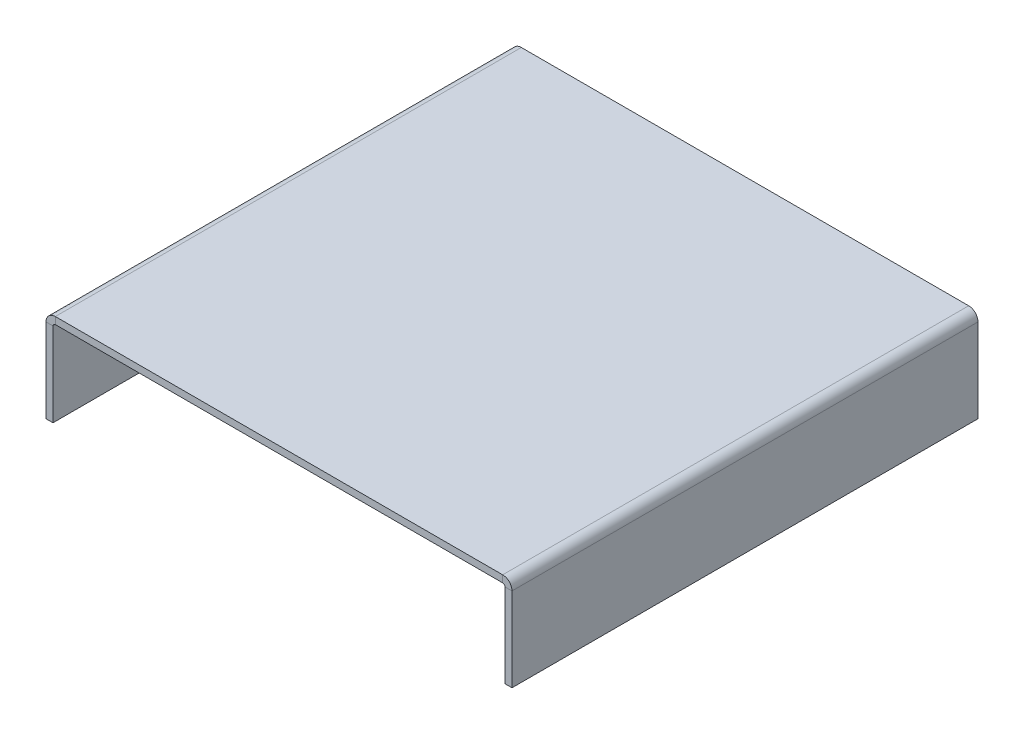
ISO-10303-21;
HEADER;
FILE_DESCRIPTION(('STEP AP214'),'2;1');
FILE_NAME('part.step','',(''),(''),'','','');
FILE_SCHEMA(('AUTOMOTIVE_DESIGN { 1 0 10303 214 1 1 1 1 }'));
ENDSEC;
DATA;
#1=APPLICATION_CONTEXT('core data for automotive mechanical design processes');
#2=APPLICATION_PROTOCOL_DEFINITION('international standard','automotive_design',2000,#1);
#3=PRODUCT_CONTEXT('',#1,'mechanical');
#4=PRODUCT('Part','Part','',(#3));
#5=PRODUCT_RELATED_PRODUCT_CATEGORY('part','',(#4));
#6=PRODUCT_DEFINITION_FORMATION('','',#4);
#7=PRODUCT_DEFINITION_CONTEXT('part definition',#1,'design');
#8=PRODUCT_DEFINITION('design','',#6,#7);
#9=PRODUCT_DEFINITION_SHAPE('','',#8);
#10=(LENGTH_UNIT() NAMED_UNIT(*) SI_UNIT(.MILLI.,.METRE.));
#11=(NAMED_UNIT(*) PLANE_ANGLE_UNIT() SI_UNIT($,.RADIAN.));
#12=(NAMED_UNIT(*) SI_UNIT($,.STERADIAN.) SOLID_ANGLE_UNIT());
#13=UNCERTAINTY_MEASURE_WITH_UNIT(LENGTH_MEASURE(1.E-05),#10,'distance_accuracy_value','');
#14=(GEOMETRIC_REPRESENTATION_CONTEXT(3) GLOBAL_UNCERTAINTY_ASSIGNED_CONTEXT((#13)) GLOBAL_UNIT_ASSIGNED_CONTEXT((#10,
#11,#12)) REPRESENTATION_CONTEXT('',''));
#15=CARTESIAN_POINT('',(0.,0.,0.));
#16=DIRECTION('',(0.,0.,1.));
#17=DIRECTION('',(1.,0.,0.));
#18=AXIS2_PLACEMENT_3D('',#15,#16,#17);
#19=CARTESIAN_POINT('',(0.,-1.5,0.));
#20=DIRECTION('',(0.,-1.,0.));
#21=DIRECTION('',(0.,0.,-1.));
#22=AXIS2_PLACEMENT_3D('',#19,#20,#21);
#23=PLANE('',#22);
#24=DIRECTION('',(1.,0.,0.));
#25=VECTOR('',#24,1.);
#26=CARTESIAN_POINT('',(50.,-1.5,50.));
#27=LINE('',#26,#25);
#28=CARTESIAN_POINT('',(-48.,-1.50000000000001,50.));
#29=VERTEX_POINT('',#28);
#30=CARTESIAN_POINT('',(48.,-1.5,50.));
#31=VERTEX_POINT('',#30);
#32=EDGE_CURVE('E84',#29,#31,#27,.T.);
#33=ORIENTED_EDGE('',*,*,#32,.F.);
#34=DIRECTION('',(0.,0.,-1.));
#35=VECTOR('',#34,1.);
#36=CARTESIAN_POINT('',(-48.,-1.50000000000001,-50.));
#37=LINE('',#36,#35);
#38=CARTESIAN_POINT('',(-48.,-1.50000000000001,-50.));
#39=VERTEX_POINT('',#38);
#40=EDGE_CURVE('E220',#39,#29,#37,.F.);
#41=ORIENTED_EDGE('',*,*,#40,.F.);
#42=DIRECTION('',(-1.,0.,0.));
#43=VECTOR('',#42,1.);
#44=CARTESIAN_POINT('',(50.,-1.5,-50.));
#45=LINE('',#44,#43);
#46=CARTESIAN_POINT('',(48.,-1.5,-50.));
#47=VERTEX_POINT('',#46);
#48=EDGE_CURVE('E13',#47,#39,#45,.T.);
#49=ORIENTED_EDGE('',*,*,#48,.F.);
#50=DIRECTION('',(0.,0.,1.));
#51=VECTOR('',#50,1.);
#52=CARTESIAN_POINT('',(48.,-1.5,50.));
#53=LINE('',#52,#51);
#54=EDGE_CURVE('E274',#31,#47,#53,.F.);
#55=ORIENTED_EDGE('',*,*,#54,.F.);
#56=EDGE_LOOP('',(#33,#41,#49,#55));
#57=FACE_BOUND('',#56,.T.);
#58=ADVANCED_FACE('F75',(#57),#23,.T.);
#59=CARTESIAN_POINT('',(0.,0.,0.));
#60=DIRECTION('',(0.,-1.,0.));
#61=DIRECTION('',(0.,0.,-1.));
#62=AXIS2_PLACEMENT_3D('',#59,#60,#61);
#63=PLANE('',#62);
#64=DIRECTION('',(0.,0.,-1.));
#65=VECTOR('',#64,1.);
#66=CARTESIAN_POINT('',(-48.,0.,-50.));
#67=LINE('',#66,#65);
#68=CARTESIAN_POINT('',(-48.,0.,-50.));
#69=VERTEX_POINT('',#68);
#70=CARTESIAN_POINT('',(-48.,0.,50.));
#71=VERTEX_POINT('',#70);
#72=EDGE_CURVE('E208',#69,#71,#67,.F.);
#73=ORIENTED_EDGE('',*,*,#72,.T.);
#74=DIRECTION('',(1.,0.,0.));
#75=VECTOR('',#74,1.);
#76=CARTESIAN_POINT('',(50.,0.,50.));
#77=LINE('',#76,#75);
#78=CARTESIAN_POINT('',(48.,0.,50.));
#79=VERTEX_POINT('',#78);
#80=EDGE_CURVE('E280',#71,#79,#77,.T.);
#81=ORIENTED_EDGE('',*,*,#80,.T.);
#82=DIRECTION('',(0.,0.,1.));
#83=VECTOR('',#82,1.);
#84=CARTESIAN_POINT('',(48.,0.,50.));
#85=LINE('',#84,#83);
#86=CARTESIAN_POINT('',(48.,0.,-50.));
#87=VERTEX_POINT('',#86);
#88=EDGE_CURVE('E262',#79,#87,#85,.F.);
#89=ORIENTED_EDGE('',*,*,#88,.T.);
#90=DIRECTION('',(-1.,0.,0.));
#91=VECTOR('',#90,1.);
#92=CARTESIAN_POINT('',(50.,0.,-50.));
#93=LINE('',#92,#91);
#94=EDGE_CURVE('E79',#87,#69,#93,.T.);
#95=ORIENTED_EDGE('',*,*,#94,.T.);
#96=EDGE_LOOP('',(#73,#81,#89,#95));
#97=FACE_BOUND('',#96,.T.);
#98=ADVANCED_FACE('F286',(#97),#63,.F.);
#99=CARTESIAN_POINT('',(50.,-1.5,-50.));
#100=DIRECTION('',(0.,0.,-1.));
#101=DIRECTION('',(-1.,0.,0.));
#102=AXIS2_PLACEMENT_3D('',#99,#100,#101);
#103=PLANE('',#102);
#104=ORIENTED_EDGE('',*,*,#48,.T.);
#105=DIRECTION('',(0.,1.,0.));
#106=VECTOR('',#105,1.);
#107=CARTESIAN_POINT('',(-48.,-1.50000000000001,-50.));
#108=LINE('',#107,#106);
#109=EDGE_CURVE('E214',#39,#69,#108,.T.);
#110=ORIENTED_EDGE('',*,*,#109,.T.);
#111=ORIENTED_EDGE('',*,*,#94,.F.);
#112=DIRECTION('',(0.,1.,0.));
#113=VECTOR('',#112,1.);
#114=CARTESIAN_POINT('',(48.,-1.5,-50.));
#115=LINE('',#114,#113);
#116=EDGE_CURVE('E98',#47,#87,#115,.T.);
#117=ORIENTED_EDGE('',*,*,#116,.F.);
#118=EDGE_LOOP('',(#104,#110,#111,#117));
#119=FACE_BOUND('',#118,.T.);
#120=ADVANCED_FACE('F289',(#119),#103,.T.);
#121=CARTESIAN_POINT('',(50.,-1.5,50.));
#122=DIRECTION('',(0.,0.,1.));
#123=DIRECTION('',(1.,0.,0.));
#124=AXIS2_PLACEMENT_3D('',#121,#122,#123);
#125=PLANE('',#124);
#126=DIRECTION('',(0.,1.,0.));
#127=VECTOR('',#126,1.);
#128=CARTESIAN_POINT('',(-48.,-1.50000000000001,50.));
#129=LINE('',#128,#127);
#130=EDGE_CURVE('E226',#29,#71,#129,.T.);
#131=ORIENTED_EDGE('',*,*,#130,.F.);
#132=ORIENTED_EDGE('',*,*,#32,.T.);
#133=DIRECTION('',(0.,1.,0.));
#134=VECTOR('',#133,1.);
#135=CARTESIAN_POINT('',(48.,-1.5,50.));
#136=LINE('',#135,#134);
#137=EDGE_CURVE('E268',#31,#79,#136,.T.);
#138=ORIENTED_EDGE('',*,*,#137,.T.);
#139=ORIENTED_EDGE('',*,*,#80,.F.);
#140=EDGE_LOOP('',(#131,#132,#138,#139));
#141=FACE_BOUND('',#140,.T.);
#142=ADVANCED_FACE('F77',(#141),#125,.T.);
#143=CARTESIAN_POINT('',(48.,-2.,-50.));
#144=DIRECTION('',(0.,0.,-1.));
#145=DIRECTION('',(-1.,0.,0.));
#146=AXIS2_PLACEMENT_3D('',#143,#144,#145);
#147=PLANE('',#146);
#148=DIRECTION('',(-1.,0.,0.));
#149=VECTOR('',#148,1.);
#150=CARTESIAN_POINT('',(50.,-2.,-50.));
#151=LINE('',#150,#149);
#152=CARTESIAN_POINT('',(48.5,-2.,-50.));
#153=VERTEX_POINT('',#152);
#154=CARTESIAN_POINT('',(50.,-2.,-50.));
#155=VERTEX_POINT('',#154);
#156=EDGE_CURVE('E229',#153,#155,#151,.F.);
#157=ORIENTED_EDGE('',*,*,#156,.F.);
#158=CARTESIAN_POINT('',(48.,-2.,-50.));
#159=DIRECTION('',(0.,0.,1.));
#160=DIRECTION('',(1.,0.,0.));
#161=AXIS2_PLACEMENT_3D('',#158,#159,#160);
#162=CIRCLE('',#161,0.5);
#163=EDGE_CURVE('E271',#47,#153,#162,.F.);
#164=ORIENTED_EDGE('',*,*,#163,.F.);
#165=ORIENTED_EDGE('',*,*,#116,.T.);
#166=CARTESIAN_POINT('',(48.,-2.,-50.));
#167=DIRECTION('',(0.,0.,1.));
#168=DIRECTION('',(1.,0.,0.));
#169=AXIS2_PLACEMENT_3D('',#166,#167,#168);
#170=CIRCLE('',#169,2.);
#171=EDGE_CURVE('E264',#87,#155,#170,.F.);
#172=ORIENTED_EDGE('',*,*,#171,.T.);
#173=EDGE_LOOP('',(#157,#164,#165,#172));
#174=FACE_BOUND('',#173,.T.);
#175=ADVANCED_FACE('F341',(#174),#147,.T.);
#176=CARTESIAN_POINT('',(48.,-2.,50.));
#177=DIRECTION('',(0.,0.,-1.));
#178=DIRECTION('',(-1.,0.,0.));
#179=AXIS2_PLACEMENT_3D('',#176,#177,#178);
#180=PLANE('',#179);
#181=CARTESIAN_POINT('',(48.,-2.,50.));
#182=DIRECTION('',(0.,0.,1.));
#183=DIRECTION('',(1.,0.,0.));
#184=AXIS2_PLACEMENT_3D('',#181,#182,#183);
#185=CIRCLE('',#184,0.5);
#186=CARTESIAN_POINT('',(48.5,-2.,50.));
#187=VERTEX_POINT('',#186);
#188=EDGE_CURVE('E235',#187,#31,#185,.T.);
#189=ORIENTED_EDGE('',*,*,#188,.F.);
#190=DIRECTION('',(-1.,0.,0.));
#191=VECTOR('',#190,1.);
#192=CARTESIAN_POINT('',(48.5,-2.,50.));
#193=LINE('',#192,#191);
#194=CARTESIAN_POINT('',(50.,-2.,50.));
#195=VERTEX_POINT('',#194);
#196=EDGE_CURVE('E255',#187,#195,#193,.F.);
#197=ORIENTED_EDGE('',*,*,#196,.T.);
#198=CARTESIAN_POINT('',(48.,-2.,50.));
#199=DIRECTION('',(0.,0.,1.));
#200=DIRECTION('',(1.,0.,0.));
#201=AXIS2_PLACEMENT_3D('',#198,#199,#200);
#202=CIRCLE('',#201,2.);
#203=EDGE_CURVE('E265',#195,#79,#202,.T.);
#204=ORIENTED_EDGE('',*,*,#203,.T.);
#205=ORIENTED_EDGE('',*,*,#137,.F.);
#206=EDGE_LOOP('',(#189,#197,#204,#205));
#207=FACE_BOUND('',#206,.T.);
#208=ADVANCED_FACE('F314',(#207),#180,.F.);
#209=CARTESIAN_POINT('',(48.,-2.,50.));
#210=DIRECTION('',(0.,0.,1.));
#211=DIRECTION('',(1.,0.,0.));
#212=AXIS2_PLACEMENT_3D('',#209,#210,#211);
#213=CYLINDRICAL_SURFACE('',#212,2.);
#214=ORIENTED_EDGE('',*,*,#88,.F.);
#215=ORIENTED_EDGE('',*,*,#203,.F.);
#216=DIRECTION('',(0.,0.,1.));
#217=VECTOR('',#216,1.);
#218=CARTESIAN_POINT('',(50.,-2.,-50.));
#219=LINE('',#218,#217);
#220=EDGE_CURVE('E253',#195,#155,#219,.F.);
#221=ORIENTED_EDGE('',*,*,#220,.T.);
#222=ORIENTED_EDGE('',*,*,#171,.F.);
#223=EDGE_LOOP('',(#214,#215,#221,#222));
#224=FACE_BOUND('',#223,.T.);
#225=ADVANCED_FACE('F339',(#224),#213,.T.);
#226=CARTESIAN_POINT('',(48.,-2.,50.));
#227=DIRECTION('',(0.,0.,1.));
#228=DIRECTION('',(1.,0.,0.));
#229=AXIS2_PLACEMENT_3D('',#226,#227,#228);
#230=CYLINDRICAL_SURFACE('',#229,0.5);
#231=ORIENTED_EDGE('',*,*,#54,.T.);
#232=ORIENTED_EDGE('',*,*,#163,.T.);
#233=DIRECTION('',(0.,0.,1.));
#234=VECTOR('',#233,1.);
#235=CARTESIAN_POINT('',(48.5,-2.,-50.));
#236=LINE('',#235,#234);
#237=EDGE_CURVE('E258',#153,#187,#236,.T.);
#238=ORIENTED_EDGE('',*,*,#237,.T.);
#239=ORIENTED_EDGE('',*,*,#188,.T.);
#240=EDGE_LOOP('',(#231,#232,#238,#239));
#241=FACE_BOUND('',#240,.T.);
#242=ADVANCED_FACE('F316',(#241),#230,.F.);
#243=CARTESIAN_POINT('',(50.0000000000001,-20.,50.));
#244=DIRECTION('',(0.,0.,-1.));
#245=DIRECTION('',(-1.,0.,0.));
#246=AXIS2_PLACEMENT_3D('',#243,#244,#245);
#247=PLANE('',#246);
#248=ORIENTED_EDGE('',*,*,#196,.F.);
#249=DIRECTION('',(0.,1.,0.));
#250=VECTOR('',#249,1.);
#251=CARTESIAN_POINT('',(48.5000000000001,-20.,50.));
#252=LINE('',#251,#250);
#253=CARTESIAN_POINT('',(48.5000000000001,-20.,50.));
#254=VERTEX_POINT('',#253);
#255=EDGE_CURVE('E251',#187,#254,#252,.F.);
#256=ORIENTED_EDGE('',*,*,#255,.T.);
#257=DIRECTION('',(-1.,0.,0.));
#258=VECTOR('',#257,1.);
#259=CARTESIAN_POINT('',(50.0000000000001,-20.,50.));
#260=LINE('',#259,#258);
#261=CARTESIAN_POINT('',(50.0000000000001,-20.,50.));
#262=VERTEX_POINT('',#261);
#263=EDGE_CURVE('E232',#262,#254,#260,.T.);
#264=ORIENTED_EDGE('',*,*,#263,.F.);
#265=DIRECTION('',(0.,-1.,0.));
#266=VECTOR('',#265,1.);
#267=CARTESIAN_POINT('',(50.,1.74021127778981E-13,50.));
#268=LINE('',#267,#266);
#269=EDGE_CURVE('E244',#195,#262,#268,.T.);
#270=ORIENTED_EDGE('',*,*,#269,.F.);
#271=EDGE_LOOP('',(#248,#256,#264,#270));
#272=FACE_BOUND('',#271,.T.);
#273=ADVANCED_FACE('F333',(#272),#247,.F.);
#274=CARTESIAN_POINT('',(50.,-1.49999999999999,-50.));
#275=DIRECTION('',(0.,0.,1.));
#276=DIRECTION('',(1.,0.,0.));
#277=AXIS2_PLACEMENT_3D('',#274,#275,#276);
#278=PLANE('',#277);
#279=ORIENTED_EDGE('',*,*,#156,.T.);
#280=DIRECTION('',(0.,1.,0.));
#281=VECTOR('',#280,1.);
#282=CARTESIAN_POINT('',(50.,1.74021127778981E-13,-50.));
#283=LINE('',#282,#281);
#284=CARTESIAN_POINT('',(50.0000000000001,-20.,-50.));
#285=VERTEX_POINT('',#284);
#286=EDGE_CURVE('E239',#285,#155,#283,.T.);
#287=ORIENTED_EDGE('',*,*,#286,.F.);
#288=DIRECTION('',(-1.,0.,0.));
#289=VECTOR('',#288,1.);
#290=CARTESIAN_POINT('',(50.0000000000001,-20.,-50.));
#291=LINE('',#290,#289);
#292=CARTESIAN_POINT('',(48.5000000000001,-20.,-50.));
#293=VERTEX_POINT('',#292);
#294=EDGE_CURVE('E236',#285,#293,#291,.T.);
#295=ORIENTED_EDGE('',*,*,#294,.T.);
#296=DIRECTION('',(0.,-1.,0.));
#297=VECTOR('',#296,1.);
#298=CARTESIAN_POINT('',(48.5,-1.5,-50.));
#299=LINE('',#298,#297);
#300=EDGE_CURVE('E246',#293,#153,#299,.F.);
#301=ORIENTED_EDGE('',*,*,#300,.T.);
#302=EDGE_LOOP('',(#279,#287,#295,#301));
#303=FACE_BOUND('',#302,.T.);
#304=ADVANCED_FACE('F324',(#303),#278,.F.);
#305=CARTESIAN_POINT('',(50.,1.74021127778981E-13,0.));
#306=DIRECTION('',(-1.,0.,0.));
#307=DIRECTION('',(0.,-1.,0.));
#308=AXIS2_PLACEMENT_3D('',#305,#306,#307);
#309=PLANE('',#308);
#310=ORIENTED_EDGE('',*,*,#220,.F.);
#311=ORIENTED_EDGE('',*,*,#269,.T.);
#312=DIRECTION('',(0.,0.,-1.));
#313=VECTOR('',#312,1.);
#314=CARTESIAN_POINT('',(50.0000000000001,-20.,0.));
#315=LINE('',#314,#313);
#316=EDGE_CURVE('E242',#262,#285,#315,.T.);
#317=ORIENTED_EDGE('',*,*,#316,.T.);
#318=ORIENTED_EDGE('',*,*,#286,.T.);
#319=EDGE_LOOP('',(#310,#311,#317,#318));
#320=FACE_BOUND('',#319,.T.);
#321=ADVANCED_FACE('F336',(#320),#309,.F.);
#322=CARTESIAN_POINT('',(48.5,1.68783905770716E-13,0.));
#323=DIRECTION('',(-1.,0.,0.));
#324=DIRECTION('',(0.,-1.,0.));
#325=AXIS2_PLACEMENT_3D('',#322,#323,#324);
#326=PLANE('',#325);
#327=ORIENTED_EDGE('',*,*,#255,.F.);
#328=ORIENTED_EDGE('',*,*,#237,.F.);
#329=ORIENTED_EDGE('',*,*,#300,.F.);
#330=DIRECTION('',(0.,0.,1.));
#331=VECTOR('',#330,1.);
#332=CARTESIAN_POINT('',(48.5000000000001,-20.,-50.));
#333=LINE('',#332,#331);
#334=EDGE_CURVE('E249',#254,#293,#333,.F.);
#335=ORIENTED_EDGE('',*,*,#334,.F.);
#336=EDGE_LOOP('',(#327,#328,#329,#335));
#337=FACE_BOUND('',#336,.T.);
#338=ADVANCED_FACE('F321',(#337),#326,.T.);
#339=CARTESIAN_POINT('',(50.0000000000001,-20.,-50.));
#340=DIRECTION('',(0.,1.,0.));
#341=DIRECTION('',(-1.,0.,0.));
#342=AXIS2_PLACEMENT_3D('',#339,#340,#341);
#343=PLANE('',#342);
#344=ORIENTED_EDGE('',*,*,#334,.T.);
#345=ORIENTED_EDGE('',*,*,#294,.F.);
#346=ORIENTED_EDGE('',*,*,#316,.F.);
#347=ORIENTED_EDGE('',*,*,#263,.T.);
#348=EDGE_LOOP('',(#344,#345,#346,#347));
#349=FACE_BOUND('',#348,.T.);
#350=ADVANCED_FACE('F329',(#349),#343,.F.);
#351=CARTESIAN_POINT('',(-48.,-2.,50.));
#352=DIRECTION('',(0.,0.,1.));
#353=DIRECTION('',(1.,0.,0.));
#354=AXIS2_PLACEMENT_3D('',#351,#352,#353);
#355=PLANE('',#354);
#356=DIRECTION('',(1.,0.,0.));
#357=VECTOR('',#356,1.);
#358=CARTESIAN_POINT('',(-50.,-2.,50.));
#359=LINE('',#358,#357);
#360=CARTESIAN_POINT('',(-48.5,-2.,50.));
#361=VERTEX_POINT('',#360);
#362=CARTESIAN_POINT('',(-50.,-2.,50.));
#363=VERTEX_POINT('',#362);
#364=EDGE_CURVE('E190',#361,#363,#359,.F.);
#365=ORIENTED_EDGE('',*,*,#364,.F.);
#366=CARTESIAN_POINT('',(-48.,-2.,50.));
#367=DIRECTION('',(0.,0.,-1.));
#368=DIRECTION('',(-1.,0.,0.));
#369=AXIS2_PLACEMENT_3D('',#366,#367,#368);
#370=CIRCLE('',#369,0.499999999999994);
#371=EDGE_CURVE('E217',#29,#361,#370,.F.);
#372=ORIENTED_EDGE('',*,*,#371,.F.);
#373=ORIENTED_EDGE('',*,*,#130,.T.);
#374=CARTESIAN_POINT('',(-48.,-2.,50.));
#375=DIRECTION('',(0.,0.,-1.));
#376=DIRECTION('',(-1.,0.,0.));
#377=AXIS2_PLACEMENT_3D('',#374,#375,#376);
#378=CIRCLE('',#377,1.99999999999999);
#379=EDGE_CURVE('E210',#71,#363,#378,.F.);
#380=ORIENTED_EDGE('',*,*,#379,.T.);
#381=EDGE_LOOP('',(#365,#372,#373,#380));
#382=FACE_BOUND('',#381,.T.);
#383=ADVANCED_FACE('F307',(#382),#355,.T.);
#384=CARTESIAN_POINT('',(-48.,-2.,-50.));
#385=DIRECTION('',(0.,0.,1.));
#386=DIRECTION('',(1.,0.,0.));
#387=AXIS2_PLACEMENT_3D('',#384,#385,#386);
#388=PLANE('',#387);
#389=CARTESIAN_POINT('',(-48.,-2.,-50.));
#390=DIRECTION('',(0.,0.,-1.));
#391=DIRECTION('',(-1.,0.,0.));
#392=AXIS2_PLACEMENT_3D('',#389,#390,#391);
#393=CIRCLE('',#392,0.499999999999994);
#394=CARTESIAN_POINT('',(-48.5,-2.,-50.));
#395=VERTEX_POINT('',#394);
#396=EDGE_CURVE('E223',#395,#39,#393,.T.);
#397=ORIENTED_EDGE('',*,*,#396,.F.);
#398=DIRECTION('',(1.,0.,0.));
#399=VECTOR('',#398,1.);
#400=CARTESIAN_POINT('',(-48.5,-2.,-50.));
#401=LINE('',#400,#399);
#402=CARTESIAN_POINT('',(-50.,-2.,-50.));
#403=VERTEX_POINT('',#402);
#404=EDGE_CURVE('E202',#395,#403,#401,.F.);
#405=ORIENTED_EDGE('',*,*,#404,.T.);
#406=CARTESIAN_POINT('',(-48.,-2.,-50.));
#407=DIRECTION('',(0.,0.,-1.));
#408=DIRECTION('',(-1.,0.,0.));
#409=AXIS2_PLACEMENT_3D('',#406,#407,#408);
#410=CIRCLE('',#409,1.99999999999999);
#411=EDGE_CURVE('E211',#403,#69,#410,.T.);
#412=ORIENTED_EDGE('',*,*,#411,.T.);
#413=ORIENTED_EDGE('',*,*,#109,.F.);
#414=EDGE_LOOP('',(#397,#405,#412,#413));
#415=FACE_BOUND('',#414,.T.);
#416=ADVANCED_FACE('F295',(#415),#388,.F.);
#417=CARTESIAN_POINT('',(-48.,-2.,-50.));
#418=DIRECTION('',(0.,0.,-1.));
#419=DIRECTION('',(-1.,0.,0.));
#420=AXIS2_PLACEMENT_3D('',#417,#418,#419);
#421=CYLINDRICAL_SURFACE('',#420,1.99999999999999);
#422=ORIENTED_EDGE('',*,*,#72,.F.);
#423=ORIENTED_EDGE('',*,*,#411,.F.);
#424=DIRECTION('',(0.,0.,-1.));
#425=VECTOR('',#424,1.);
#426=CARTESIAN_POINT('',(-50.,-2.,50.));
#427=LINE('',#426,#425);
#428=EDGE_CURVE('E200',#403,#363,#427,.F.);
#429=ORIENTED_EDGE('',*,*,#428,.T.);
#430=ORIENTED_EDGE('',*,*,#379,.F.);
#431=EDGE_LOOP('',(#422,#423,#429,#430));
#432=FACE_BOUND('',#431,.T.);
#433=ADVANCED_FACE('F294',(#432),#421,.T.);
#434=CARTESIAN_POINT('',(-48.,-2.,-50.));
#435=DIRECTION('',(0.,0.,-1.));
#436=DIRECTION('',(-1.,0.,0.));
#437=AXIS2_PLACEMENT_3D('',#434,#435,#436);
#438=CYLINDRICAL_SURFACE('',#437,0.499999999999994);
#439=ORIENTED_EDGE('',*,*,#40,.T.);
#440=ORIENTED_EDGE('',*,*,#371,.T.);
#441=DIRECTION('',(0.,0.,-1.));
#442=VECTOR('',#441,1.);
#443=CARTESIAN_POINT('',(-48.5,-2.,50.));
#444=LINE('',#443,#442);
#445=EDGE_CURVE('E205',#361,#395,#444,.T.);
#446=ORIENTED_EDGE('',*,*,#445,.T.);
#447=ORIENTED_EDGE('',*,*,#396,.T.);
#448=EDGE_LOOP('',(#439,#440,#446,#447));
#449=FACE_BOUND('',#448,.T.);
#450=ADVANCED_FACE('F304',(#449),#438,.F.);
#451=CARTESIAN_POINT('',(-50.0000000000001,-20.,-50.));
#452=DIRECTION('',(0.,0.,1.));
#453=DIRECTION('',(1.,0.,0.));
#454=AXIS2_PLACEMENT_3D('',#451,#452,#453);
#455=PLANE('',#454);
#456=ORIENTED_EDGE('',*,*,#404,.F.);
#457=DIRECTION('',(0.,1.,0.));
#458=VECTOR('',#457,1.);
#459=CARTESIAN_POINT('',(-48.5000000000001,-20.,-50.));
#460=LINE('',#459,#458);
#461=CARTESIAN_POINT('',(-48.5000000000001,-20.,-50.));
#462=VERTEX_POINT('',#461);
#463=EDGE_CURVE('E198',#395,#462,#460,.F.);
#464=ORIENTED_EDGE('',*,*,#463,.T.);
#465=DIRECTION('',(1.,0.,0.));
#466=VECTOR('',#465,1.);
#467=CARTESIAN_POINT('',(-50.0000000000001,-20.,-50.));
#468=LINE('',#467,#466);
#469=CARTESIAN_POINT('',(-50.0000000000001,-20.,-50.));
#470=VERTEX_POINT('',#469);
#471=EDGE_CURVE('E186',#470,#462,#468,.T.);
#472=ORIENTED_EDGE('',*,*,#471,.F.);
#473=DIRECTION('',(0.,-1.,0.));
#474=VECTOR('',#473,1.);
#475=CARTESIAN_POINT('',(-50.,1.92774895086838E-13,-50.));
#476=LINE('',#475,#474);
#477=EDGE_CURVE('E173',#403,#470,#476,.T.);
#478=ORIENTED_EDGE('',*,*,#477,.F.);
#479=EDGE_LOOP('',(#456,#464,#472,#478));
#480=FACE_BOUND('',#479,.T.);
#481=ADVANCED_FACE('F299',(#480),#455,.F.);
#482=CARTESIAN_POINT('',(-50.,-1.49999999999999,50.));
#483=DIRECTION('',(0.,0.,-1.));
#484=DIRECTION('',(-1.,0.,0.));
#485=AXIS2_PLACEMENT_3D('',#482,#483,#484);
#486=PLANE('',#485);
#487=ORIENTED_EDGE('',*,*,#364,.T.);
#488=DIRECTION('',(0.,1.,0.));
#489=VECTOR('',#488,1.);
#490=CARTESIAN_POINT('',(-50.,1.92774895086838E-13,50.));
#491=LINE('',#490,#489);
#492=CARTESIAN_POINT('',(-50.0000000000001,-20.,50.));
#493=VERTEX_POINT('',#492);
#494=EDGE_CURVE('E171',#493,#363,#491,.T.);
#495=ORIENTED_EDGE('',*,*,#494,.F.);
#496=DIRECTION('',(1.,0.,0.));
#497=VECTOR('',#496,1.);
#498=CARTESIAN_POINT('',(-50.,-20.,50.));
#499=LINE('',#498,#497);
#500=CARTESIAN_POINT('',(-48.5000000000001,-20.,50.));
#501=VERTEX_POINT('',#500);
#502=EDGE_CURVE('E179',#493,#501,#499,.T.);
#503=ORIENTED_EDGE('',*,*,#502,.T.);
#504=DIRECTION('',(0.,-1.,0.));
#505=VECTOR('',#504,1.);
#506=CARTESIAN_POINT('',(-48.5,-1.5,50.));
#507=LINE('',#506,#505);
#508=EDGE_CURVE('E195',#501,#361,#507,.F.);
#509=ORIENTED_EDGE('',*,*,#508,.T.);
#510=EDGE_LOOP('',(#487,#495,#503,#509));
#511=FACE_BOUND('',#510,.T.);
#512=ADVANCED_FACE('F189',(#511),#486,.F.);
#513=CARTESIAN_POINT('',(-50.,1.92774895086838E-13,0.));
#514=DIRECTION('',(1.,0.,0.));
#515=DIRECTION('',(0.,1.,0.));
#516=AXIS2_PLACEMENT_3D('',#513,#514,#515);
#517=PLANE('',#516);
#518=ORIENTED_EDGE('',*,*,#428,.F.);
#519=ORIENTED_EDGE('',*,*,#477,.T.);
#520=DIRECTION('',(0.,0.,1.));
#521=VECTOR('',#520,1.);
#522=CARTESIAN_POINT('',(-50.0000000000001,-20.,0.));
#523=LINE('',#522,#521);
#524=EDGE_CURVE('E166',#470,#493,#523,.T.);
#525=ORIENTED_EDGE('',*,*,#524,.T.);
#526=ORIENTED_EDGE('',*,*,#494,.T.);
#527=EDGE_LOOP('',(#518,#519,#525,#526));
#528=FACE_BOUND('',#527,.T.);
#529=ADVANCED_FACE('F169',(#528),#517,.F.);
#530=CARTESIAN_POINT('',(-48.5,1.87537673078574E-13,0.));
#531=DIRECTION('',(1.,0.,0.));
#532=DIRECTION('',(0.,1.,0.));
#533=AXIS2_PLACEMENT_3D('',#530,#531,#532);
#534=PLANE('',#533);
#535=ORIENTED_EDGE('',*,*,#463,.F.);
#536=ORIENTED_EDGE('',*,*,#445,.F.);
#537=ORIENTED_EDGE('',*,*,#508,.F.);
#538=DIRECTION('',(0.,0.,-1.));
#539=VECTOR('',#538,1.);
#540=CARTESIAN_POINT('',(-48.5000000000001,-20.,50.));
#541=LINE('',#540,#539);
#542=EDGE_CURVE('E182',#462,#501,#541,.F.);
#543=ORIENTED_EDGE('',*,*,#542,.F.);
#544=EDGE_LOOP('',(#535,#536,#537,#543));
#545=FACE_BOUND('',#544,.T.);
#546=ADVANCED_FACE('F302',(#545),#534,.T.);
#547=CARTESIAN_POINT('',(-50.0000000000001,-20.,50.));
#548=DIRECTION('',(0.,1.,0.));
#549=DIRECTION('',(-1.,0.,0.));
#550=AXIS2_PLACEMENT_3D('',#547,#548,#549);
#551=PLANE('',#550);
#552=ORIENTED_EDGE('',*,*,#542,.T.);
#553=ORIENTED_EDGE('',*,*,#502,.F.);
#554=ORIENTED_EDGE('',*,*,#524,.F.);
#555=ORIENTED_EDGE('',*,*,#471,.T.);
#556=EDGE_LOOP('',(#552,#553,#554,#555));
#557=FACE_BOUND('',#556,.T.);
#558=ADVANCED_FACE('F180',(#557),#551,.F.);
#559=CLOSED_SHELL('',(#58,#98,#120,#142,#175,#208,#225,#242,#273,#304,#321,#338,#350,#383,#416,
#433,#450,#481,#512,#529,#546,#558));
#560=MANIFOLD_SOLID_BREP('B2',#559);
#561=ADVANCED_BREP_SHAPE_REPRESENTATION('',(#18,#560),#14);
#562=SHAPE_DEFINITION_REPRESENTATION(#9,#561);
ENDSEC;
END-ISO-10303-21;
